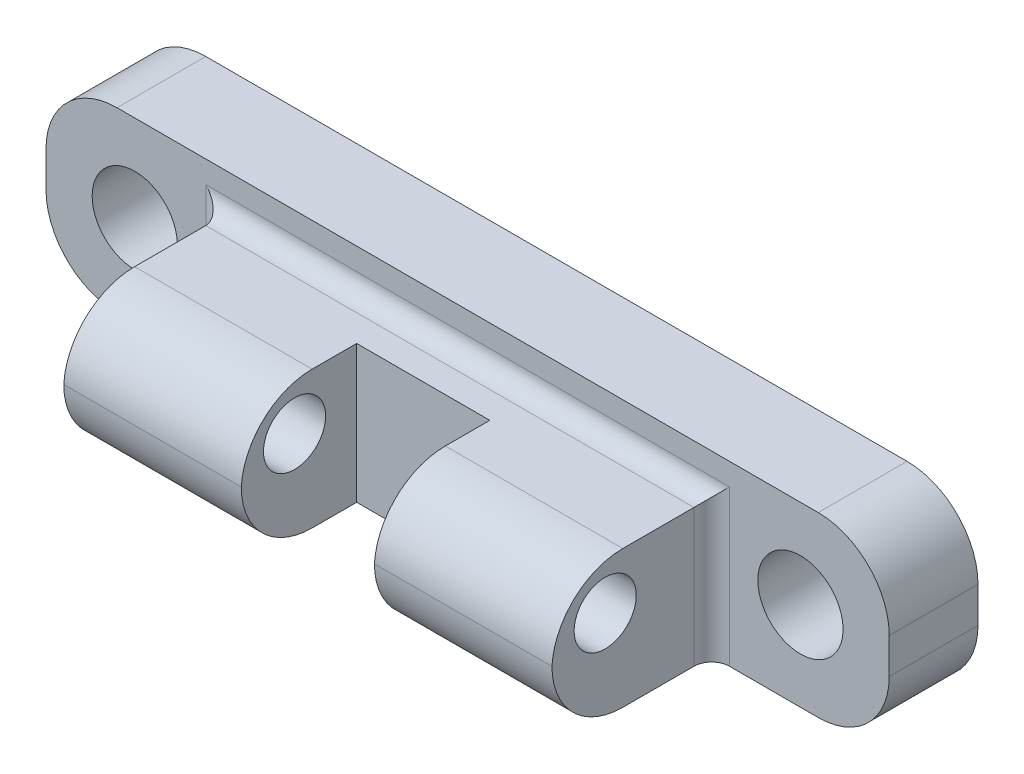
ISO-10303-21;
HEADER;
FILE_DESCRIPTION(('STEP AP214'),'2;1');
FILE_NAME('part.step','',(''),(''),'','','');
FILE_SCHEMA(('AUTOMOTIVE_DESIGN { 1 0 10303 214 1 1 1 1 }'));
ENDSEC;
DATA;
#1=APPLICATION_CONTEXT('core data for automotive mechanical design processes');
#2=APPLICATION_PROTOCOL_DEFINITION('international standard','automotive_design',2000,#1);
#3=PRODUCT_CONTEXT('',#1,'mechanical');
#4=PRODUCT('Part','Part','',(#3));
#5=PRODUCT_RELATED_PRODUCT_CATEGORY('part','',(#4));
#6=PRODUCT_DEFINITION_FORMATION('','',#4);
#7=PRODUCT_DEFINITION_CONTEXT('part definition',#1,'design');
#8=PRODUCT_DEFINITION('design','',#6,#7);
#9=PRODUCT_DEFINITION_SHAPE('','',#8);
#10=(LENGTH_UNIT() NAMED_UNIT(*) SI_UNIT(.MILLI.,.METRE.));
#11=(NAMED_UNIT(*) PLANE_ANGLE_UNIT() SI_UNIT($,.RADIAN.));
#12=(NAMED_UNIT(*) SI_UNIT($,.STERADIAN.) SOLID_ANGLE_UNIT());
#13=UNCERTAINTY_MEASURE_WITH_UNIT(LENGTH_MEASURE(1.E-05),#10,'distance_accuracy_value','');
#14=(GEOMETRIC_REPRESENTATION_CONTEXT(3) GLOBAL_UNCERTAINTY_ASSIGNED_CONTEXT((#13)) GLOBAL_UNIT_ASSIGNED_CONTEXT((#10,
#11,#12)) REPRESENTATION_CONTEXT('',''));
#15=CARTESIAN_POINT('',(0.,0.,0.));
#16=DIRECTION('',(0.,0.,1.));
#17=DIRECTION('',(1.,0.,0.));
#18=AXIS2_PLACEMENT_3D('',#15,#16,#17);
#19=CARTESIAN_POINT('',(37.5,10.,0.));
#20=DIRECTION('',(-1.,0.,0.));
#21=DIRECTION('',(0.,0.,1.));
#22=AXIS2_PLACEMENT_3D('',#19,#20,#21);
#23=PLANE('',#22);
#24=DIRECTION('',(0.,-1.,0.));
#25=VECTOR('',#24,1.);
#26=CARTESIAN_POINT('',(37.5,10.,-6.29356275814105));
#27=LINE('',#26,#25);
#28=CARTESIAN_POINT('',(37.5,6.,-6.29356275814105));
#29=VERTEX_POINT('',#28);
#30=CARTESIAN_POINT('',(37.5,4.,-6.29356275814105));
#31=VERTEX_POINT('',#30);
#32=EDGE_CURVE('E239',#29,#31,#27,.T.);
#33=ORIENTED_EDGE('',*,*,#32,.T.);
#34=DIRECTION('',(0.,0.,-1.));
#35=VECTOR('',#34,1.);
#36=CARTESIAN_POINT('',(37.5,4.,0.));
#37=LINE('',#36,#35);
#38=CARTESIAN_POINT('',(37.5,4.,-11.2935627581411));
#39=VERTEX_POINT('',#38);
#40=EDGE_CURVE('E330',#31,#39,#37,.T.);
#41=ORIENTED_EDGE('',*,*,#40,.T.);
#42=DIRECTION('',(0.,-1.,0.));
#43=VECTOR('',#42,1.);
#44=CARTESIAN_POINT('',(37.5,10.,-11.2935627581411));
#45=LINE('',#44,#43);
#46=CARTESIAN_POINT('',(37.5,6.,-11.2935627581411));
#47=VERTEX_POINT('',#46);
#48=EDGE_CURVE('E235',#47,#39,#45,.T.);
#49=ORIENTED_EDGE('',*,*,#48,.F.);
#50=DIRECTION('',(0.,0.,-1.));
#51=VECTOR('',#50,1.);
#52=CARTESIAN_POINT('',(37.5,6.,-6.29356275814105));
#53=LINE('',#52,#51);
#54=EDGE_CURVE('E327',#47,#29,#53,.F.);
#55=ORIENTED_EDGE('',*,*,#54,.T.);
#56=EDGE_LOOP('',(#33,#41,#49,#55));
#57=FACE_BOUND('',#56,.T.);
#58=ADVANCED_FACE('F45',(#57),#23,.F.);
#59=CARTESIAN_POINT('',(0.,10.,-11.2935627581411));
#60=DIRECTION('',(0.,0.,-1.));
#61=DIRECTION('',(-1.,0.,0.));
#62=AXIS2_PLACEMENT_3D('',#59,#60,#61);
#63=PLANE('',#62);
#64=CARTESIAN_POINT('',(-5.,5.,-11.2935627581411));
#65=DIRECTION('',(0.,0.,-1.));
#66=DIRECTION('',(-1.,0.,0.));
#67=AXIS2_PLACEMENT_3D('',#64,#65,#66);
#68=CIRCLE('',#67,2.4);
#69=CARTESIAN_POINT('',(-7.4,5.,-11.2935627581411));
#70=VERTEX_POINT('',#69);
#71=EDGE_CURVE('E254',#70,#70,#68,.T.);
#72=ORIENTED_EDGE('',*,*,#71,.F.);
#73=EDGE_LOOP('',(#72));
#74=FACE_BOUND('',#73,.T.);
#75=CARTESIAN_POINT('',(32.5,5.,-11.2935627581411));
#76=DIRECTION('',(0.,0.,-1.));
#77=DIRECTION('',(-1.,0.,0.));
#78=AXIS2_PLACEMENT_3D('',#75,#76,#77);
#79=CIRCLE('',#78,2.4);
#80=CARTESIAN_POINT('',(30.1,5.,-11.2935627581411));
#81=VERTEX_POINT('',#80);
#82=EDGE_CURVE('E256',#81,#81,#79,.T.);
#83=ORIENTED_EDGE('',*,*,#82,.F.);
#84=EDGE_LOOP('',(#83));
#85=FACE_BOUND('',#84,.T.);
#86=DIRECTION('',(1.,0.,0.));
#87=VECTOR('',#86,1.);
#88=CARTESIAN_POINT('',(0.,0.,-11.2935627581411));
#89=LINE('',#88,#87);
#90=CARTESIAN_POINT('',(-6.00000000000001,0.,-11.2935627581411));
#91=VERTEX_POINT('',#90);
#92=CARTESIAN_POINT('',(33.5,0.,-11.2935627581411));
#93=VERTEX_POINT('',#92);
#94=EDGE_CURVE('E406',#91,#93,#89,.T.);
#95=ORIENTED_EDGE('',*,*,#94,.F.);
#96=CARTESIAN_POINT('',(-6.00000000000001,4.,-11.2935627581411));
#97=DIRECTION('',(0.,0.,-1.));
#98=DIRECTION('',(-1.,0.,0.));
#99=AXIS2_PLACEMENT_3D('',#96,#97,#98);
#100=CIRCLE('',#99,4.);
#101=CARTESIAN_POINT('',(-10.,4.,-11.2935627581411));
#102=VERTEX_POINT('',#101);
#103=EDGE_CURVE('E316',#91,#102,#100,.T.);
#104=ORIENTED_EDGE('',*,*,#103,.T.);
#105=DIRECTION('',(0.,-1.,0.));
#106=VECTOR('',#105,1.);
#107=CARTESIAN_POINT('',(-10.,10.,-11.2935627581411));
#108=LINE('',#107,#106);
#109=CARTESIAN_POINT('',(-10.,6.,-11.2935627581411));
#110=VERTEX_POINT('',#109);
#111=EDGE_CURVE('E231',#110,#102,#108,.T.);
#112=ORIENTED_EDGE('',*,*,#111,.F.);
#113=CARTESIAN_POINT('',(-6.00000000000001,6.,-11.2935627581411));
#114=DIRECTION('',(0.,0.,-1.));
#115=DIRECTION('',(-1.,0.,0.));
#116=AXIS2_PLACEMENT_3D('',#113,#114,#115);
#117=CIRCLE('',#116,4.);
#118=CARTESIAN_POINT('',(-6.00000000000001,10.,-11.2935627581411));
#119=VERTEX_POINT('',#118);
#120=EDGE_CURVE('E313',#110,#119,#117,.T.);
#121=ORIENTED_EDGE('',*,*,#120,.T.);
#122=DIRECTION('',(1.,0.,0.));
#123=VECTOR('',#122,1.);
#124=CARTESIAN_POINT('',(0.,10.,-11.2935627581411));
#125=LINE('',#124,#123);
#126=CARTESIAN_POINT('',(33.5,10.,-11.2935627581411));
#127=VERTEX_POINT('',#126);
#128=EDGE_CURVE('E215',#119,#127,#125,.T.);
#129=ORIENTED_EDGE('',*,*,#128,.T.);
#130=CARTESIAN_POINT('',(33.5,6.,-11.2935627581411));
#131=DIRECTION('',(0.,0.,-1.));
#132=DIRECTION('',(-1.,0.,0.));
#133=AXIS2_PLACEMENT_3D('',#130,#131,#132);
#134=CIRCLE('',#133,4.);
#135=EDGE_CURVE('E307',#127,#47,#134,.T.);
#136=ORIENTED_EDGE('',*,*,#135,.T.);
#137=ORIENTED_EDGE('',*,*,#48,.T.);
#138=CARTESIAN_POINT('',(33.5,4.,-11.2935627581411));
#139=DIRECTION('',(0.,0.,-1.));
#140=DIRECTION('',(-1.,0.,0.));
#141=AXIS2_PLACEMENT_3D('',#138,#139,#140);
#142=CIRCLE('',#141,4.);
#143=EDGE_CURVE('E310',#39,#93,#142,.T.);
#144=ORIENTED_EDGE('',*,*,#143,.T.);
#145=EDGE_LOOP('',(#95,#104,#112,#121,#129,#136,#137,#144));
#146=FACE_BOUND('',#145,.T.);
#147=ADVANCED_FACE('F472',(#74,#85,#146),#63,.T.);
#148=CARTESIAN_POINT('',(-10.,10.,0.));
#149=DIRECTION('',(1.,0.,0.));
#150=DIRECTION('',(0.,0.,-1.));
#151=AXIS2_PLACEMENT_3D('',#148,#149,#150);
#152=PLANE('',#151);
#153=ORIENTED_EDGE('',*,*,#111,.T.);
#154=DIRECTION('',(0.,0.,1.));
#155=VECTOR('',#154,1.);
#156=CARTESIAN_POINT('',(-10.,4.,0.));
#157=LINE('',#156,#155);
#158=CARTESIAN_POINT('',(-10.,4.,-6.29356275814105));
#159=VERTEX_POINT('',#158);
#160=EDGE_CURVE('E290',#102,#159,#157,.T.);
#161=ORIENTED_EDGE('',*,*,#160,.T.);
#162=DIRECTION('',(0.,-1.,0.));
#163=VECTOR('',#162,1.);
#164=CARTESIAN_POINT('',(-10.,10.,-6.29356275814105));
#165=LINE('',#164,#163);
#166=CARTESIAN_POINT('',(-10.,6.,-6.29356275814105));
#167=VERTEX_POINT('',#166);
#168=EDGE_CURVE('E219',#167,#159,#165,.T.);
#169=ORIENTED_EDGE('',*,*,#168,.F.);
#170=DIRECTION('',(0.,0.,1.));
#171=VECTOR('',#170,1.);
#172=CARTESIAN_POINT('',(-10.,6.,-11.2935627581411));
#173=LINE('',#172,#171);
#174=EDGE_CURVE('E287',#167,#110,#173,.F.);
#175=ORIENTED_EDGE('',*,*,#174,.T.);
#176=EDGE_LOOP('',(#153,#161,#169,#175));
#177=FACE_BOUND('',#176,.T.);
#178=ADVANCED_FACE('F466',(#177),#152,.F.);
#179=CARTESIAN_POINT('',(0.,10.,-6.29356275814105));
#180=DIRECTION('',(0.,0.,-1.));
#181=DIRECTION('',(-1.,0.,0.));
#182=AXIS2_PLACEMENT_3D('',#179,#180,#181);
#183=PLANE('',#182);
#184=DIRECTION('',(1.,0.,0.));
#185=VECTOR('',#184,1.);
#186=CARTESIAN_POINT('',(0.,0.,-6.29356275814105));
#187=LINE('',#186,#185);
#188=CARTESIAN_POINT('',(-6.00000000000001,0.,-6.29356275814105));
#189=VERTEX_POINT('',#188);
#190=CARTESIAN_POINT('',(-1.,0.,-6.29356275814105));
#191=VERTEX_POINT('',#190);
#192=EDGE_CURVE('E411',#189,#191,#187,.T.);
#193=ORIENTED_EDGE('',*,*,#192,.T.);
#194=DIRECTION('',(0.,-1.,0.));
#195=VECTOR('',#194,1.);
#196=CARTESIAN_POINT('',(-1.,7.75,-6.29356275814105));
#197=LINE('',#196,#195);
#198=CARTESIAN_POINT('',(-1.,8.75,-6.29356275814105));
#199=VERTEX_POINT('',#198);
#200=EDGE_CURVE('E370',#191,#199,#197,.F.);
#201=ORIENTED_EDGE('',*,*,#200,.T.);
#202=DIRECTION('',(1.,0.,0.));
#203=VECTOR('',#202,1.);
#204=CARTESIAN_POINT('',(27.5,8.75,-6.29356275814105));
#205=LINE('',#204,#203);
#206=CARTESIAN_POINT('',(28.5,8.75,-6.29356275814105));
#207=VERTEX_POINT('',#206);
#208=EDGE_CURVE('E364',#199,#207,#205,.T.);
#209=ORIENTED_EDGE('',*,*,#208,.T.);
#210=DIRECTION('',(0.,-1.,0.));
#211=VECTOR('',#210,1.);
#212=CARTESIAN_POINT('',(28.5,0.,-6.29356275814105));
#213=LINE('',#212,#211);
#214=CARTESIAN_POINT('',(28.5,0.,-6.29356275814105));
#215=VERTEX_POINT('',#214);
#216=EDGE_CURVE('E367',#207,#215,#213,.T.);
#217=ORIENTED_EDGE('',*,*,#216,.T.);
#218=DIRECTION('',(1.,0.,0.));
#219=VECTOR('',#218,1.);
#220=CARTESIAN_POINT('',(0.,0.,-6.29356275814105));
#221=LINE('',#220,#219);
#222=CARTESIAN_POINT('',(33.5,0.,-6.29356275814105));
#223=VERTEX_POINT('',#222);
#224=EDGE_CURVE('E399',#215,#223,#221,.T.);
#225=ORIENTED_EDGE('',*,*,#224,.T.);
#226=CARTESIAN_POINT('',(33.5,4.,-6.29356275814105));
#227=DIRECTION('',(0.,0.,-1.));
#228=DIRECTION('',(-1.,0.,0.));
#229=AXIS2_PLACEMENT_3D('',#226,#227,#228);
#230=CIRCLE('',#229,4.);
#231=EDGE_CURVE('E337',#223,#31,#230,.F.);
#232=ORIENTED_EDGE('',*,*,#231,.T.);
#233=ORIENTED_EDGE('',*,*,#32,.F.);
#234=CARTESIAN_POINT('',(33.5,6.,-6.29356275814105));
#235=DIRECTION('',(0.,0.,-1.));
#236=DIRECTION('',(-1.,0.,0.));
#237=AXIS2_PLACEMENT_3D('',#234,#235,#236);
#238=CIRCLE('',#237,4.);
#239=CARTESIAN_POINT('',(33.5,10.,-6.29356275814105));
#240=VERTEX_POINT('',#239);
#241=EDGE_CURVE('E334',#29,#240,#238,.F.);
#242=ORIENTED_EDGE('',*,*,#241,.T.);
#243=DIRECTION('',(1.,0.,0.));
#244=VECTOR('',#243,1.);
#245=CARTESIAN_POINT('',(0.,10.,-6.29356275814105));
#246=LINE('',#245,#244);
#247=CARTESIAN_POINT('',(-6.00000000000001,10.,-6.29356275814105));
#248=VERTEX_POINT('',#247);
#249=EDGE_CURVE('E222',#248,#240,#246,.T.);
#250=ORIENTED_EDGE('',*,*,#249,.F.);
#251=CARTESIAN_POINT('',(-6.00000000000001,6.,-6.29356275814105));
#252=DIRECTION('',(0.,0.,-1.));
#253=DIRECTION('',(-1.,0.,0.));
#254=AXIS2_PLACEMENT_3D('',#251,#252,#253);
#255=CIRCLE('',#254,4.);
#256=EDGE_CURVE('E294',#248,#167,#255,.F.);
#257=ORIENTED_EDGE('',*,*,#256,.T.);
#258=ORIENTED_EDGE('',*,*,#168,.T.);
#259=CARTESIAN_POINT('',(-6.00000000000001,4.,-6.29356275814105));
#260=DIRECTION('',(0.,0.,-1.));
#261=DIRECTION('',(-1.,0.,0.));
#262=AXIS2_PLACEMENT_3D('',#259,#260,#261);
#263=CIRCLE('',#262,4.);
#264=EDGE_CURVE('E297',#159,#189,#263,.F.);
#265=ORIENTED_EDGE('',*,*,#264,.T.);
#266=EDGE_LOOP('',(#193,#201,#209,#217,#225,#232,#233,#242,#250,#257,#258,#265));
#267=FACE_BOUND('',#266,.T.);
#268=CARTESIAN_POINT('',(-5.,5.,-6.29356275814105));
#269=DIRECTION('',(0.,0.,-1.));
#270=DIRECTION('',(-1.,0.,0.));
#271=AXIS2_PLACEMENT_3D('',#268,#269,#270);
#272=CIRCLE('',#271,2.4);
#273=CARTESIAN_POINT('',(-7.4,5.,-6.29356275814105));
#274=VERTEX_POINT('',#273);
#275=EDGE_CURVE('E250',#274,#274,#272,.T.);
#276=ORIENTED_EDGE('',*,*,#275,.T.);
#277=EDGE_LOOP('',(#276));
#278=FACE_BOUND('',#277,.T.);
#279=CARTESIAN_POINT('',(32.5,5.,-6.29356275814105));
#280=DIRECTION('',(0.,0.,-1.));
#281=DIRECTION('',(-1.,0.,0.));
#282=AXIS2_PLACEMENT_3D('',#279,#280,#281);
#283=CIRCLE('',#282,2.4);
#284=CARTESIAN_POINT('',(30.1,5.,-6.29356275814105));
#285=VERTEX_POINT('',#284);
#286=EDGE_CURVE('E249',#285,#285,#283,.T.);
#287=ORIENTED_EDGE('',*,*,#286,.T.);
#288=EDGE_LOOP('',(#287));
#289=FACE_BOUND('',#288,.T.);
#290=ADVANCED_FACE('F397',(#267,#278,#289),#183,.F.);
#291=CARTESIAN_POINT('',(0.,10.,0.));
#292=DIRECTION('',(1.,0.,0.));
#293=DIRECTION('',(0.,0.,-1.));
#294=AXIS2_PLACEMENT_3D('',#291,#292,#293);
#295=PLANE('',#294);
#296=CARTESIAN_POINT('',(0.,5.09687160160865,-0.29356275814105));
#297=DIRECTION('',(1.,0.,0.));
#298=DIRECTION('',(0.,0.,-1.));
#299=AXIS2_PLACEMENT_3D('',#296,#297,#298);
#300=CIRCLE('',#299,1.75);
#301=CARTESIAN_POINT('',(0.,5.09687160160865,-2.04356275814105));
#302=VERTEX_POINT('',#301);
#303=EDGE_CURVE('E407',#302,#302,#300,.T.);
#304=ORIENTED_EDGE('',*,*,#303,.T.);
#305=EDGE_LOOP('',(#304));
#306=FACE_BOUND('',#305,.T.);
#307=DIRECTION('',(0.,0.,-1.));
#308=VECTOR('',#307,1.);
#309=CARTESIAN_POINT('',(0.,7.75,0.));
#310=LINE('',#309,#308);
#311=CARTESIAN_POINT('',(0.,7.75,-1.28574261380887));
#312=VERTEX_POINT('',#311);
#313=CARTESIAN_POINT('',(0.,7.75,-5.29356275814105));
#314=VERTEX_POINT('',#313);
#315=EDGE_CURVE('E255',#312,#314,#310,.T.);
#316=ORIENTED_EDGE('',*,*,#315,.T.);
#317=DIRECTION('',(0.,-1.,0.));
#318=VECTOR('',#317,1.);
#319=CARTESIAN_POINT('',(0.,0.,-5.29356275814105));
#320=LINE('',#319,#318);
#321=CARTESIAN_POINT('',(0.,0.,-5.29356275814105));
#322=VERTEX_POINT('',#321);
#323=EDGE_CURVE('E360',#314,#322,#320,.T.);
#324=ORIENTED_EDGE('',*,*,#323,.T.);
#325=DIRECTION('',(0.,0.,1.));
#326=VECTOR('',#325,1.);
#327=CARTESIAN_POINT('',(0.,0.,0.));
#328=LINE('',#327,#326);
#329=CARTESIAN_POINT('',(0.,0.,-1.29356275814105));
#330=VERTEX_POINT('',#329);
#331=EDGE_CURVE('E420',#322,#330,#328,.T.);
#332=ORIENTED_EDGE('',*,*,#331,.T.);
#333=CARTESIAN_POINT('',(0.,4.,-1.29356275814105));
#334=DIRECTION('',(1.,0.,0.));
#335=DIRECTION('',(0.,0.,-1.));
#336=AXIS2_PLACEMENT_3D('',#333,#334,#335);
#337=CIRCLE('',#336,4.);
#338=CARTESIAN_POINT('',(0.,4.,2.70643724185895));
#339=VERTEX_POINT('',#338);
#340=EDGE_CURVE('E267',#330,#339,#337,.F.);
#341=ORIENTED_EDGE('',*,*,#340,.T.);
#342=CARTESIAN_POINT('',(0.,3.75,-1.28574261380887));
#343=DIRECTION('',(1.,0.,0.));
#344=DIRECTION('',(0.,0.,-1.));
#345=AXIS2_PLACEMENT_3D('',#342,#343,#344);
#346=CIRCLE('',#345,4.);
#347=EDGE_CURVE('E357',#339,#312,#346,.F.);
#348=ORIENTED_EDGE('',*,*,#347,.T.);
#349=EDGE_LOOP('',(#316,#324,#332,#341,#348));
#350=FACE_BOUND('',#349,.T.);
#351=ADVANCED_FACE('F454',(#306,#350),#295,.F.);
#352=CARTESIAN_POINT('',(10.,10.,0.));
#353=DIRECTION('',(1.,0.,0.));
#354=DIRECTION('',(0.,0.,-1.));
#355=AXIS2_PLACEMENT_3D('',#352,#353,#354);
#356=PLANE('',#355);
#357=DIRECTION('',(0.,0.,-1.));
#358=VECTOR('',#357,1.);
#359=CARTESIAN_POINT('',(10.,7.75,0.));
#360=LINE('',#359,#358);
#361=CARTESIAN_POINT('',(10.,7.75,-1.28574261380888));
#362=VERTEX_POINT('',#361);
#363=CARTESIAN_POINT('',(10.,7.75,-3.79356275814105));
#364=VERTEX_POINT('',#363);
#365=EDGE_CURVE('E193',#362,#364,#360,.T.);
#366=ORIENTED_EDGE('',*,*,#365,.F.);
#367=CARTESIAN_POINT('',(10.,3.75,-1.28574261380888));
#368=DIRECTION('',(1.,0.,0.));
#369=DIRECTION('',(0.,0.,-1.));
#370=AXIS2_PLACEMENT_3D('',#367,#368,#369);
#371=CIRCLE('',#370,4.);
#372=CARTESIAN_POINT('',(10.,4.,2.70643724185895));
#373=VERTEX_POINT('',#372);
#374=EDGE_CURVE('E354',#362,#373,#371,.T.);
#375=ORIENTED_EDGE('',*,*,#374,.T.);
#376=CARTESIAN_POINT('',(10.,4.,-1.29356275814105));
#377=DIRECTION('',(1.,0.,0.));
#378=DIRECTION('',(0.,0.,-1.));
#379=AXIS2_PLACEMENT_3D('',#376,#377,#378);
#380=CIRCLE('',#379,4.);
#381=CARTESIAN_POINT('',(10.,0.,-1.29356275814105));
#382=VERTEX_POINT('',#381);
#383=EDGE_CURVE('E274',#373,#382,#380,.T.);
#384=ORIENTED_EDGE('',*,*,#383,.T.);
#385=DIRECTION('',(0.,0.,1.));
#386=VECTOR('',#385,1.);
#387=CARTESIAN_POINT('',(10.,0.,0.));
#388=LINE('',#387,#386);
#389=CARTESIAN_POINT('',(10.,0.,-3.79356275814105));
#390=VERTEX_POINT('',#389);
#391=EDGE_CURVE('E423',#390,#382,#388,.T.);
#392=ORIENTED_EDGE('',*,*,#391,.F.);
#393=DIRECTION('',(0.,-1.,0.));
#394=VECTOR('',#393,1.);
#395=CARTESIAN_POINT('',(10.,10.,-3.79356275814105));
#396=LINE('',#395,#394);
#397=EDGE_CURVE('E214',#364,#390,#396,.T.);
#398=ORIENTED_EDGE('',*,*,#397,.F.);
#399=EDGE_LOOP('',(#366,#375,#384,#392,#398));
#400=FACE_BOUND('',#399,.T.);
#401=CARTESIAN_POINT('',(10.,5.09687160160865,-0.29356275814105));
#402=DIRECTION('',(1.,0.,0.));
#403=DIRECTION('',(0.,0.,-1.));
#404=AXIS2_PLACEMENT_3D('',#401,#402,#403);
#405=CIRCLE('',#404,1.75);
#406=CARTESIAN_POINT('',(10.,5.09687160160865,-2.04356275814105));
#407=VERTEX_POINT('',#406);
#408=EDGE_CURVE('E414',#407,#407,#405,.T.);
#409=ORIENTED_EDGE('',*,*,#408,.F.);
#410=EDGE_LOOP('',(#409));
#411=FACE_BOUND('',#410,.T.);
#412=ADVANCED_FACE('F541',(#400,#411),#356,.T.);
#413=CARTESIAN_POINT('',(0.,10.,-3.79356275814105));
#414=DIRECTION('',(0.,0.,1.));
#415=DIRECTION('',(1.,0.,0.));
#416=AXIS2_PLACEMENT_3D('',#413,#414,#415);
#417=PLANE('',#416);
#418=DIRECTION('',(1.,0.,0.));
#419=VECTOR('',#418,1.);
#420=CARTESIAN_POINT('',(0.,7.75,-3.79356275814105));
#421=LINE('',#420,#419);
#422=CARTESIAN_POINT('',(17.5,7.75,-3.79356275814105));
#423=VERTEX_POINT('',#422);
#424=EDGE_CURVE('E185',#364,#423,#421,.T.);
#425=ORIENTED_EDGE('',*,*,#424,.F.);
#426=ORIENTED_EDGE('',*,*,#397,.T.);
#427=DIRECTION('',(-1.,0.,0.));
#428=VECTOR('',#427,1.);
#429=CARTESIAN_POINT('',(0.,0.,-3.79356275814105));
#430=LINE('',#429,#428);
#431=CARTESIAN_POINT('',(17.5,0.,-3.79356275814105));
#432=VERTEX_POINT('',#431);
#433=EDGE_CURVE('E212',#432,#390,#430,.T.);
#434=ORIENTED_EDGE('',*,*,#433,.F.);
#435=DIRECTION('',(0.,-1.,0.));
#436=VECTOR('',#435,1.);
#437=CARTESIAN_POINT('',(17.5,10.,-3.79356275814105));
#438=LINE('',#437,#436);
#439=EDGE_CURVE('E203',#423,#432,#438,.T.);
#440=ORIENTED_EDGE('',*,*,#439,.F.);
#441=EDGE_LOOP('',(#425,#426,#434,#440));
#442=FACE_BOUND('',#441,.T.);
#443=ADVANCED_FACE('F210',(#442),#417,.T.);
#444=CARTESIAN_POINT('',(17.5,10.,0.));
#445=DIRECTION('',(-1.,0.,0.));
#446=DIRECTION('',(0.,0.,1.));
#447=AXIS2_PLACEMENT_3D('',#444,#445,#446);
#448=PLANE('',#447);
#449=CARTESIAN_POINT('',(17.5,4.,-1.29356275814105));
#450=DIRECTION('',(-1.,0.,0.));
#451=DIRECTION('',(0.,0.,1.));
#452=AXIS2_PLACEMENT_3D('',#449,#450,#451);
#453=CIRCLE('',#452,4.);
#454=CARTESIAN_POINT('',(17.5,0.,-1.29356275814105));
#455=VERTEX_POINT('',#454);
#456=CARTESIAN_POINT('',(17.5,4.,2.70643724185895));
#457=VERTEX_POINT('',#456);
#458=EDGE_CURVE('E277',#455,#457,#453,.T.);
#459=ORIENTED_EDGE('',*,*,#458,.T.);
#460=CARTESIAN_POINT('',(17.5,3.75,-1.28574261380888));
#461=DIRECTION('',(-1.,0.,0.));
#462=DIRECTION('',(0.,0.,1.));
#463=AXIS2_PLACEMENT_3D('',#460,#461,#462);
#464=CIRCLE('',#463,4.);
#465=CARTESIAN_POINT('',(17.5,7.75,-1.28574261380888));
#466=VERTEX_POINT('',#465);
#467=EDGE_CURVE('E206',#457,#466,#464,.T.);
#468=ORIENTED_EDGE('',*,*,#467,.T.);
#469=DIRECTION('',(0.,0.,1.));
#470=VECTOR('',#469,1.);
#471=CARTESIAN_POINT('',(17.5,7.75,0.));
#472=LINE('',#471,#470);
#473=EDGE_CURVE('E189',#423,#466,#472,.T.);
#474=ORIENTED_EDGE('',*,*,#473,.F.);
#475=ORIENTED_EDGE('',*,*,#439,.T.);
#476=DIRECTION('',(0.,0.,-1.));
#477=VECTOR('',#476,1.);
#478=CARTESIAN_POINT('',(17.5,0.,0.));
#479=LINE('',#478,#477);
#480=EDGE_CURVE('E428',#455,#432,#479,.T.);
#481=ORIENTED_EDGE('',*,*,#480,.F.);
#482=EDGE_LOOP('',(#459,#468,#474,#475,#481));
#483=FACE_BOUND('',#482,.T.);
#484=CARTESIAN_POINT('',(17.5,5.09687160160865,-0.29356275814105));
#485=DIRECTION('',(-1.,0.,0.));
#486=DIRECTION('',(0.,0.,1.));
#487=AXIS2_PLACEMENT_3D('',#484,#485,#486);
#488=CIRCLE('',#487,1.75);
#489=CARTESIAN_POINT('',(17.5,5.09687160160865,1.45643724185895));
#490=VERTEX_POINT('',#489);
#491=EDGE_CURVE('E248',#490,#490,#488,.T.);
#492=ORIENTED_EDGE('',*,*,#491,.F.);
#493=EDGE_LOOP('',(#492));
#494=FACE_BOUND('',#493,.T.);
#495=ADVANCED_FACE('F200',(#483,#494),#448,.T.);
#496=CARTESIAN_POINT('',(27.5,10.,0.));
#497=DIRECTION('',(-1.,0.,0.));
#498=DIRECTION('',(0.,0.,1.));
#499=AXIS2_PLACEMENT_3D('',#496,#497,#498);
#500=PLANE('',#499);
#501=CARTESIAN_POINT('',(27.5,5.09687160160865,-0.29356275814105));
#502=DIRECTION('',(-1.,0.,0.));
#503=DIRECTION('',(0.,0.,1.));
#504=AXIS2_PLACEMENT_3D('',#501,#502,#503);
#505=CIRCLE('',#504,1.75);
#506=CARTESIAN_POINT('',(27.5,5.09687160160865,1.45643724185895));
#507=VERTEX_POINT('',#506);
#508=EDGE_CURVE('E244',#507,#507,#505,.T.);
#509=ORIENTED_EDGE('',*,*,#508,.T.);
#510=EDGE_LOOP('',(#509));
#511=FACE_BOUND('',#510,.T.);
#512=DIRECTION('',(0.,0.,-1.));
#513=VECTOR('',#512,1.);
#514=CARTESIAN_POINT('',(27.5,0.,0.));
#515=LINE('',#514,#513);
#516=CARTESIAN_POINT('',(27.5,0.,-1.29356275814105));
#517=VERTEX_POINT('',#516);
#518=CARTESIAN_POINT('',(27.5,0.,-5.29356275814105));
#519=VERTEX_POINT('',#518);
#520=EDGE_CURVE('E225',#517,#519,#515,.T.);
#521=ORIENTED_EDGE('',*,*,#520,.T.);
#522=DIRECTION('',(0.,-1.,0.));
#523=VECTOR('',#522,1.);
#524=CARTESIAN_POINT('',(27.5,7.75,-5.29356275814105));
#525=LINE('',#524,#523);
#526=CARTESIAN_POINT('',(27.5,7.75,-5.29356275814105));
#527=VERTEX_POINT('',#526);
#528=EDGE_CURVE('E68',#519,#527,#525,.F.);
#529=ORIENTED_EDGE('',*,*,#528,.T.);
#530=DIRECTION('',(0.,0.,1.));
#531=VECTOR('',#530,1.);
#532=CARTESIAN_POINT('',(27.5,7.75,0.));
#533=LINE('',#532,#531);
#534=CARTESIAN_POINT('',(27.5,7.75,-1.28574261380888));
#535=VERTEX_POINT('',#534);
#536=EDGE_CURVE('E340',#527,#535,#533,.T.);
#537=ORIENTED_EDGE('',*,*,#536,.T.);
#538=CARTESIAN_POINT('',(27.5,3.75,-1.28574261380888));
#539=DIRECTION('',(-1.,0.,0.));
#540=DIRECTION('',(0.,0.,1.));
#541=AXIS2_PLACEMENT_3D('',#538,#539,#540);
#542=CIRCLE('',#541,4.);
#543=CARTESIAN_POINT('',(27.5,4.,2.70643724185895));
#544=VERTEX_POINT('',#543);
#545=EDGE_CURVE('E349',#535,#544,#542,.F.);
#546=ORIENTED_EDGE('',*,*,#545,.T.);
#547=CARTESIAN_POINT('',(27.5,4.,-1.29356275814105));
#548=DIRECTION('',(-1.,0.,0.));
#549=DIRECTION('',(0.,0.,1.));
#550=AXIS2_PLACEMENT_3D('',#547,#548,#549);
#551=CIRCLE('',#550,4.);
#552=EDGE_CURVE('E284',#544,#517,#551,.F.);
#553=ORIENTED_EDGE('',*,*,#552,.T.);
#554=EDGE_LOOP('',(#521,#529,#537,#546,#553));
#555=FACE_BOUND('',#554,.T.);
#556=ADVANCED_FACE('F555',(#511,#555),#500,.F.);
#557=CARTESIAN_POINT('',(0.,10.,0.));
#558=DIRECTION('',(0.,1.,0.));
#559=DIRECTION('',(0.,0.,1.));
#560=AXIS2_PLACEMENT_3D('',#557,#558,#559);
#561=PLANE('',#560);
#562=DIRECTION('',(0.,0.,1.));
#563=VECTOR('',#562,1.);
#564=CARTESIAN_POINT('',(-6.00000000000001,10.,-6.29356275814105));
#565=LINE('',#564,#563);
#566=EDGE_CURVE('E323',#119,#248,#565,.T.);
#567=ORIENTED_EDGE('',*,*,#566,.T.);
#568=ORIENTED_EDGE('',*,*,#249,.T.);
#569=DIRECTION('',(0.,0.,-1.));
#570=VECTOR('',#569,1.);
#571=CARTESIAN_POINT('',(33.5,10.,-11.2935627581411));
#572=LINE('',#571,#570);
#573=EDGE_CURVE('E319',#240,#127,#572,.T.);
#574=ORIENTED_EDGE('',*,*,#573,.T.);
#575=ORIENTED_EDGE('',*,*,#128,.F.);
#576=EDGE_LOOP('',(#567,#568,#574,#575));
#577=FACE_BOUND('',#576,.T.);
#578=ADVANCED_FACE('F478',(#577),#561,.T.);
#579=CARTESIAN_POINT('',(0.,0.,0.));
#580=DIRECTION('',(0.,1.,0.));
#581=DIRECTION('',(0.,0.,1.));
#582=AXIS2_PLACEMENT_3D('',#579,#580,#581);
#583=PLANE('',#582);
#584=ORIENTED_EDGE('',*,*,#192,.F.);
#585=DIRECTION('',(0.,0.,1.));
#586=VECTOR('',#585,1.);
#587=CARTESIAN_POINT('',(-6.,0.,0.));
#588=LINE('',#587,#586);
#589=EDGE_CURVE('E304',#189,#91,#588,.F.);
#590=ORIENTED_EDGE('',*,*,#589,.T.);
#591=ORIENTED_EDGE('',*,*,#94,.T.);
#592=DIRECTION('',(0.,0.,-1.));
#593=VECTOR('',#592,1.);
#594=CARTESIAN_POINT('',(33.5,0.,0.));
#595=LINE('',#594,#593);
#596=EDGE_CURVE('E300',#93,#223,#595,.F.);
#597=ORIENTED_EDGE('',*,*,#596,.T.);
#598=ORIENTED_EDGE('',*,*,#224,.F.);
#599=CARTESIAN_POINT('',(28.5,0.,-5.29356275814105));
#600=DIRECTION('',(0.,1.,0.));
#601=DIRECTION('',(0.,0.,1.));
#602=AXIS2_PLACEMENT_3D('',#599,#600,#601);
#603=CIRCLE('',#602,1.);
#604=EDGE_CURVE('E11',#215,#519,#603,.T.);
#605=ORIENTED_EDGE('',*,*,#604,.T.);
#606=ORIENTED_EDGE('',*,*,#520,.F.);
#607=DIRECTION('',(-1.,0.,0.));
#608=VECTOR('',#607,1.);
#609=CARTESIAN_POINT('',(17.5,0.,-1.29356275814105));
#610=LINE('',#609,#608);
#611=EDGE_CURVE('E243',#517,#455,#610,.T.);
#612=ORIENTED_EDGE('',*,*,#611,.T.);
#613=ORIENTED_EDGE('',*,*,#480,.T.);
#614=ORIENTED_EDGE('',*,*,#433,.T.);
#615=ORIENTED_EDGE('',*,*,#391,.T.);
#616=DIRECTION('',(-1.,0.,0.));
#617=VECTOR('',#616,1.);
#618=CARTESIAN_POINT('',(0.,0.,-1.29356275814105));
#619=LINE('',#618,#617);
#620=EDGE_CURVE('E263',#382,#330,#619,.T.);
#621=ORIENTED_EDGE('',*,*,#620,.T.);
#622=ORIENTED_EDGE('',*,*,#331,.F.);
#623=CARTESIAN_POINT('',(-1.,0.,-5.29356275814105));
#624=DIRECTION('',(0.,1.,0.));
#625=DIRECTION('',(0.,0.,1.));
#626=AXIS2_PLACEMENT_3D('',#623,#624,#625);
#627=CIRCLE('',#626,1.);
#628=EDGE_CURVE('E55',#322,#191,#627,.T.);
#629=ORIENTED_EDGE('',*,*,#628,.T.);
#630=EDGE_LOOP('',(#584,#590,#591,#597,#598,#605,#606,#612,#613,#614,#615,#621,#622,#629));
#631=FACE_BOUND('',#630,.T.);
#632=ADVANCED_FACE('F401',(#631),#583,.F.);
#633=CARTESIAN_POINT('',(47.5,5.09687160160865,-0.29356275814105));
#634=DIRECTION('',(-1.,0.,0.));
#635=DIRECTION('',(0.,0.,1.));
#636=AXIS2_PLACEMENT_3D('',#633,#634,#635);
#637=CYLINDRICAL_SURFACE('',#636,1.75);
#638=ORIENTED_EDGE('',*,*,#491,.T.);
#639=EDGE_LOOP('',(#638));
#640=FACE_BOUND('',#639,.T.);
#641=ORIENTED_EDGE('',*,*,#508,.F.);
#642=EDGE_LOOP('',(#641));
#643=FACE_BOUND('',#642,.T.);
#644=ADVANCED_FACE('F656',(#640,#643),#637,.F.);
#645=ORIENTED_EDGE('',*,*,#408,.T.);
#646=EDGE_LOOP('',(#645));
#647=FACE_BOUND('',#646,.T.);
#648=ORIENTED_EDGE('',*,*,#303,.F.);
#649=EDGE_LOOP('',(#648));
#650=FACE_BOUND('',#649,.T.);
#651=ADVANCED_FACE('F721',(#647,#650),#637,.F.);
#652=CARTESIAN_POINT('',(-5.,5.,-21.7935627581411));
#653=DIRECTION('',(0.,0.,1.));
#654=DIRECTION('',(1.,0.,0.));
#655=AXIS2_PLACEMENT_3D('',#652,#653,#654);
#656=CYLINDRICAL_SURFACE('',#655,2.4);
#657=ORIENTED_EDGE('',*,*,#71,.T.);
#658=EDGE_LOOP('',(#657));
#659=FACE_BOUND('',#658,.T.);
#660=ORIENTED_EDGE('',*,*,#275,.F.);
#661=EDGE_LOOP('',(#660));
#662=FACE_BOUND('',#661,.T.);
#663=ADVANCED_FACE('F711',(#659,#662),#656,.F.);
#664=CARTESIAN_POINT('',(32.5,5.,-21.7935627581411));
#665=DIRECTION('',(0.,0.,1.));
#666=DIRECTION('',(1.,0.,0.));
#667=AXIS2_PLACEMENT_3D('',#664,#665,#666);
#668=CYLINDRICAL_SURFACE('',#667,2.4);
#669=ORIENTED_EDGE('',*,*,#82,.T.);
#670=EDGE_LOOP('',(#669));
#671=FACE_BOUND('',#670,.T.);
#672=ORIENTED_EDGE('',*,*,#286,.F.);
#673=EDGE_LOOP('',(#672));
#674=FACE_BOUND('',#673,.T.);
#675=ADVANCED_FACE('F510',(#671,#674),#668,.F.);
#676=CARTESIAN_POINT('',(0.,4.,-1.29356275814105));
#677=DIRECTION('',(1.,0.,0.));
#678=DIRECTION('',(0.,0.,-1.));
#679=AXIS2_PLACEMENT_3D('',#676,#677,#678);
#680=CYLINDRICAL_SURFACE('',#679,4.);
#681=ORIENTED_EDGE('',*,*,#383,.F.);
#682=DIRECTION('',(-1.,0.,0.));
#683=VECTOR('',#682,1.);
#684=CARTESIAN_POINT('',(10.,4.,2.70643724185895));
#685=LINE('',#684,#683);
#686=EDGE_CURVE('E270',#339,#373,#685,.F.);
#687=ORIENTED_EDGE('',*,*,#686,.F.);
#688=ORIENTED_EDGE('',*,*,#340,.F.);
#689=ORIENTED_EDGE('',*,*,#620,.F.);
#690=EDGE_LOOP('',(#681,#687,#688,#689));
#691=FACE_BOUND('',#690,.T.);
#692=ADVANCED_FACE('F506',(#691),#680,.T.);
#693=CARTESIAN_POINT('',(0.,4.,-1.29356275814105));
#694=DIRECTION('',(1.,0.,0.));
#695=DIRECTION('',(0.,0.,-1.));
#696=AXIS2_PLACEMENT_3D('',#693,#694,#695);
#697=CYLINDRICAL_SURFACE('',#696,4.);
#698=ORIENTED_EDGE('',*,*,#552,.F.);
#699=DIRECTION('',(-1.,0.,0.));
#700=VECTOR('',#699,1.);
#701=CARTESIAN_POINT('',(27.5,4.,2.70643724185895));
#702=LINE('',#701,#700);
#703=EDGE_CURVE('E280',#457,#544,#702,.F.);
#704=ORIENTED_EDGE('',*,*,#703,.F.);
#705=ORIENTED_EDGE('',*,*,#458,.F.);
#706=ORIENTED_EDGE('',*,*,#611,.F.);
#707=EDGE_LOOP('',(#698,#704,#705,#706));
#708=FACE_BOUND('',#707,.T.);
#709=ADVANCED_FACE('F509',(#708),#697,.T.);
#710=CARTESIAN_POINT('',(-6.,4.,0.));
#711=DIRECTION('',(0.,0.,1.));
#712=DIRECTION('',(1.,0.,0.));
#713=AXIS2_PLACEMENT_3D('',#710,#711,#712);
#714=CYLINDRICAL_SURFACE('',#713,4.);
#715=ORIENTED_EDGE('',*,*,#103,.F.);
#716=ORIENTED_EDGE('',*,*,#589,.F.);
#717=ORIENTED_EDGE('',*,*,#264,.F.);
#718=ORIENTED_EDGE('',*,*,#160,.F.);
#719=EDGE_LOOP('',(#715,#716,#717,#718));
#720=FACE_BOUND('',#719,.T.);
#721=ADVANCED_FACE('F464',(#720),#714,.T.);
#722=CARTESIAN_POINT('',(-6.,6.,0.));
#723=DIRECTION('',(0.,0.,-1.));
#724=DIRECTION('',(-1.,0.,0.));
#725=AXIS2_PLACEMENT_3D('',#722,#723,#724);
#726=CYLINDRICAL_SURFACE('',#725,4.);
#727=ORIENTED_EDGE('',*,*,#120,.F.);
#728=ORIENTED_EDGE('',*,*,#174,.F.);
#729=ORIENTED_EDGE('',*,*,#256,.F.);
#730=ORIENTED_EDGE('',*,*,#566,.F.);
#731=EDGE_LOOP('',(#727,#728,#729,#730));
#732=FACE_BOUND('',#731,.T.);
#733=ADVANCED_FACE('F476',(#732),#726,.T.);
#734=CARTESIAN_POINT('',(33.5,4.,0.));
#735=DIRECTION('',(0.,0.,-1.));
#736=DIRECTION('',(-1.,0.,0.));
#737=AXIS2_PLACEMENT_3D('',#734,#735,#736);
#738=CYLINDRICAL_SURFACE('',#737,4.);
#739=ORIENTED_EDGE('',*,*,#231,.F.);
#740=ORIENTED_EDGE('',*,*,#596,.F.);
#741=ORIENTED_EDGE('',*,*,#143,.F.);
#742=ORIENTED_EDGE('',*,*,#40,.F.);
#743=EDGE_LOOP('',(#739,#740,#741,#742));
#744=FACE_BOUND('',#743,.T.);
#745=ADVANCED_FACE('F488',(#744),#738,.T.);
#746=CARTESIAN_POINT('',(33.5,6.,0.));
#747=DIRECTION('',(0.,0.,1.));
#748=DIRECTION('',(1.,0.,0.));
#749=AXIS2_PLACEMENT_3D('',#746,#747,#748);
#750=CYLINDRICAL_SURFACE('',#749,4.);
#751=ORIENTED_EDGE('',*,*,#241,.F.);
#752=ORIENTED_EDGE('',*,*,#54,.F.);
#753=ORIENTED_EDGE('',*,*,#135,.F.);
#754=ORIENTED_EDGE('',*,*,#573,.F.);
#755=EDGE_LOOP('',(#751,#752,#753,#754));
#756=FACE_BOUND('',#755,.T.);
#757=ADVANCED_FACE('F486',(#756),#750,.T.);
#758=CARTESIAN_POINT('',(-5.50000000000003,7.75,2.70643724185895));
#759=DIRECTION('',(0.,-1.,0.));
#760=DIRECTION('',(0.,0.,-1.));
#761=AXIS2_PLACEMENT_3D('',#758,#759,#760);
#762=PLANE('',#761);
#763=ORIENTED_EDGE('',*,*,#536,.F.);
#764=DIRECTION('',(1.,0.,0.));
#765=VECTOR('',#764,1.);
#766=CARTESIAN_POINT('',(0.,7.75,-5.29356275814105));
#767=LINE('',#766,#765);
#768=EDGE_CURVE('E375',#527,#314,#767,.F.);
#769=ORIENTED_EDGE('',*,*,#768,.T.);
#770=ORIENTED_EDGE('',*,*,#315,.F.);
#771=DIRECTION('',(-1.,0.,0.));
#772=VECTOR('',#771,1.);
#773=CARTESIAN_POINT('',(-5.50000000000003,7.75,-1.28574261380887));
#774=LINE('',#773,#772);
#775=EDGE_CURVE('E343',#312,#362,#774,.F.);
#776=ORIENTED_EDGE('',*,*,#775,.T.);
#777=ORIENTED_EDGE('',*,*,#365,.T.);
#778=ORIENTED_EDGE('',*,*,#424,.T.);
#779=ORIENTED_EDGE('',*,*,#473,.T.);
#780=DIRECTION('',(-1.,0.,0.));
#781=VECTOR('',#780,1.);
#782=CARTESIAN_POINT('',(-5.50000000000003,7.75,-1.28574261380887));
#783=LINE('',#782,#781);
#784=EDGE_CURVE('E346',#466,#535,#783,.F.);
#785=ORIENTED_EDGE('',*,*,#784,.T.);
#786=EDGE_LOOP('',(#763,#769,#770,#776,#777,#778,#779,#785));
#787=FACE_BOUND('',#786,.T.);
#788=ADVANCED_FACE('F187',(#787),#762,.F.);
#789=CARTESIAN_POINT('',(0.,3.75,-1.28574261380887));
#790=DIRECTION('',(-1.,0.,0.));
#791=DIRECTION('',(0.,0.,1.));
#792=AXIS2_PLACEMENT_3D('',#789,#790,#791);
#793=CYLINDRICAL_SURFACE('',#792,4.);
#794=ORIENTED_EDGE('',*,*,#467,.F.);
#795=ORIENTED_EDGE('',*,*,#703,.T.);
#796=ORIENTED_EDGE('',*,*,#545,.F.);
#797=ORIENTED_EDGE('',*,*,#784,.F.);
#798=EDGE_LOOP('',(#794,#795,#796,#797));
#799=FACE_BOUND('',#798,.T.);
#800=ADVANCED_FACE('F604',(#799),#793,.T.);
#801=CARTESIAN_POINT('',(0.,3.75,-1.28574261380887));
#802=DIRECTION('',(-1.,0.,0.));
#803=DIRECTION('',(0.,0.,1.));
#804=AXIS2_PLACEMENT_3D('',#801,#802,#803);
#805=CYLINDRICAL_SURFACE('',#804,4.);
#806=ORIENTED_EDGE('',*,*,#347,.F.);
#807=ORIENTED_EDGE('',*,*,#686,.T.);
#808=ORIENTED_EDGE('',*,*,#374,.F.);
#809=ORIENTED_EDGE('',*,*,#775,.F.);
#810=EDGE_LOOP('',(#806,#807,#808,#809));
#811=FACE_BOUND('',#810,.T.);
#812=ADVANCED_FACE('F609',(#811),#805,.T.);
#813=CARTESIAN_POINT('',(28.5,10.,-5.29356275814105));
#814=DIRECTION('',(0.,1.,0.));
#815=DIRECTION('',(0.,0.,1.));
#816=AXIS2_PLACEMENT_3D('',#813,#814,#815);
#817=CYLINDRICAL_SURFACE('',#816,1.);
#818=ORIENTED_EDGE('',*,*,#604,.F.);
#819=ORIENTED_EDGE('',*,*,#216,.F.);
#820=CARTESIAN_POINT('',(28.5,8.75,-5.29356275814105));
#821=DIRECTION('',(-0.707106781186547,0.707106781186547,0.));
#822=DIRECTION('',(-0.707106781186547,-0.707106781186547,0.));
#823=AXIS2_PLACEMENT_3D('',#820,#821,#822);
#824=ELLIPSE('',#823,1.41421356237309,1.);
#825=EDGE_CURVE('E49',#527,#207,#824,.F.);
#826=ORIENTED_EDGE('',*,*,#825,.F.);
#827=ORIENTED_EDGE('',*,*,#528,.F.);
#828=EDGE_LOOP('',(#818,#819,#826,#827));
#829=FACE_BOUND('',#828,.T.);
#830=ADVANCED_FACE('F47',(#829),#817,.F.);
#831=CARTESIAN_POINT('',(0.,8.75,-5.29356275814105));
#832=DIRECTION('',(-1.,0.,0.));
#833=DIRECTION('',(0.,0.,1.));
#834=AXIS2_PLACEMENT_3D('',#831,#832,#833);
#835=CYLINDRICAL_SURFACE('',#834,1.);
#836=ORIENTED_EDGE('',*,*,#825,.T.);
#837=ORIENTED_EDGE('',*,*,#208,.F.);
#838=CARTESIAN_POINT('',(-1.,8.75,-5.29356275814105));
#839=DIRECTION('',(-0.707106781186547,-0.707106781186547,0.));
#840=DIRECTION('',(-0.707106781186547,0.707106781186547,0.));
#841=AXIS2_PLACEMENT_3D('',#838,#839,#840);
#842=ELLIPSE('',#841,1.41421356237309,1.);
#843=EDGE_CURVE('E379',#314,#199,#842,.F.);
#844=ORIENTED_EDGE('',*,*,#843,.F.);
#845=ORIENTED_EDGE('',*,*,#768,.F.);
#846=EDGE_LOOP('',(#836,#837,#844,#845));
#847=FACE_BOUND('',#846,.T.);
#848=ADVANCED_FACE('F392',(#847),#835,.F.);
#849=CARTESIAN_POINT('',(-1.,10.,-5.29356275814105));
#850=DIRECTION('',(0.,1.,0.));
#851=DIRECTION('',(0.,0.,1.));
#852=AXIS2_PLACEMENT_3D('',#849,#850,#851);
#853=CYLINDRICAL_SURFACE('',#852,1.);
#854=ORIENTED_EDGE('',*,*,#843,.T.);
#855=ORIENTED_EDGE('',*,*,#200,.F.);
#856=ORIENTED_EDGE('',*,*,#628,.F.);
#857=ORIENTED_EDGE('',*,*,#323,.F.);
#858=EDGE_LOOP('',(#854,#855,#856,#857));
#859=FACE_BOUND('',#858,.T.);
#860=ADVANCED_FACE('F458',(#859),#853,.F.);
#861=CLOSED_SHELL('',(#58,#147,#178,#290,#351,#412,#443,#495,#556,#578,#632,#644,#651,#663,#675,
#692,#709,#721,#733,#745,#757,#788,#800,#812,#830,#848,#860));
#862=MANIFOLD_SOLID_BREP('B2',#861);
#863=ADVANCED_BREP_SHAPE_REPRESENTATION('',(#18,#862),#14);
#864=SHAPE_DEFINITION_REPRESENTATION(#9,#863);
ENDSEC;
END-ISO-10303-21;
